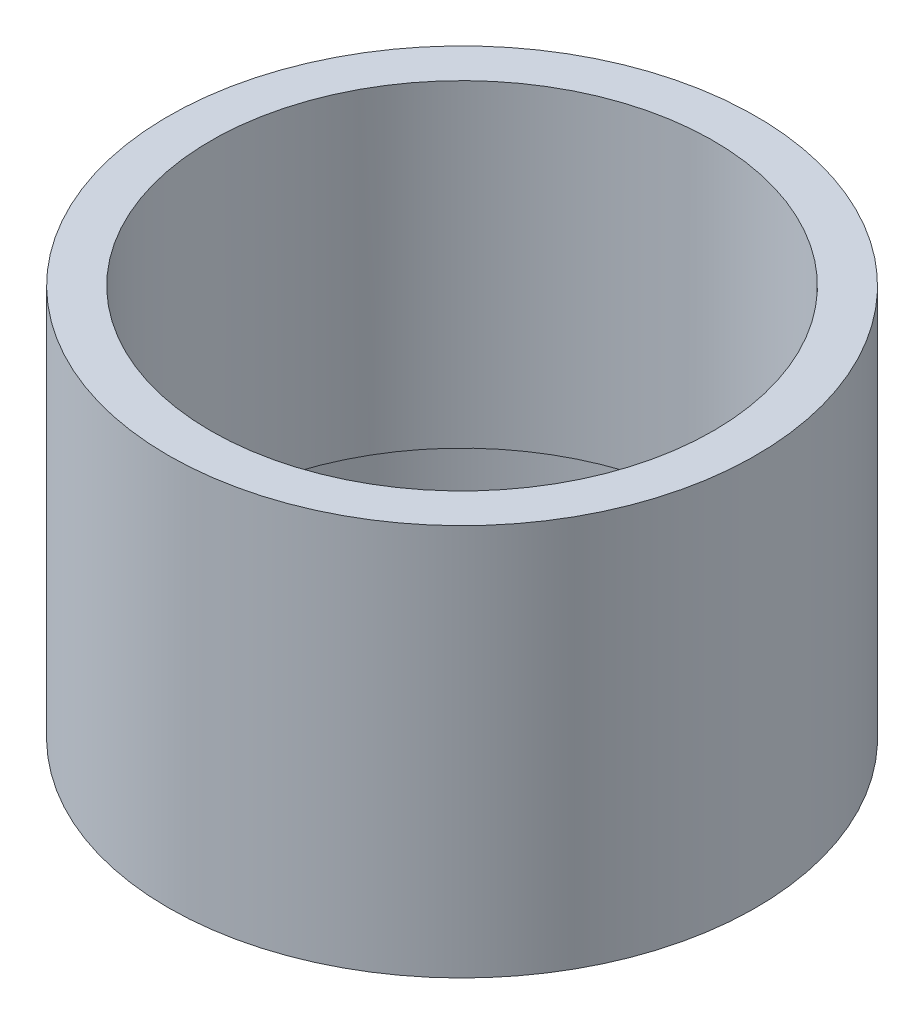
ISO-10303-21;
HEADER;
FILE_DESCRIPTION(('STEP AP214'),'2;1');
FILE_NAME('part.step','',(''),(''),'','','');
FILE_SCHEMA(('AUTOMOTIVE_DESIGN { 1 0 10303 214 1 1 1 1 }'));
ENDSEC;
DATA;
#1=APPLICATION_CONTEXT('core data for automotive mechanical design processes');
#2=APPLICATION_PROTOCOL_DEFINITION('international standard','automotive_design',2000,#1);
#3=PRODUCT_CONTEXT('',#1,'mechanical');
#4=PRODUCT('Part','Part','',(#3));
#5=PRODUCT_RELATED_PRODUCT_CATEGORY('part','',(#4));
#6=PRODUCT_DEFINITION_FORMATION('','',#4);
#7=PRODUCT_DEFINITION_CONTEXT('part definition',#1,'design');
#8=PRODUCT_DEFINITION('design','',#6,#7);
#9=PRODUCT_DEFINITION_SHAPE('','',#8);
#10=(LENGTH_UNIT() NAMED_UNIT(*) SI_UNIT(.MILLI.,.METRE.));
#11=(NAMED_UNIT(*) PLANE_ANGLE_UNIT() SI_UNIT($,.RADIAN.));
#12=(NAMED_UNIT(*) SI_UNIT($,.STERADIAN.) SOLID_ANGLE_UNIT());
#13=UNCERTAINTY_MEASURE_WITH_UNIT(LENGTH_MEASURE(1.E-05),#10,'distance_accuracy_value','');
#14=(GEOMETRIC_REPRESENTATION_CONTEXT(3) GLOBAL_UNCERTAINTY_ASSIGNED_CONTEXT((#13)) GLOBAL_UNIT_ASSIGNED_CONTEXT((#10,
#11,#12)) REPRESENTATION_CONTEXT('',''));
#15=CARTESIAN_POINT('',(0.,0.,0.));
#16=DIRECTION('',(0.,0.,1.));
#17=DIRECTION('',(1.,0.,0.));
#18=AXIS2_PLACEMENT_3D('',#15,#16,#17);
#19=CARTESIAN_POINT('',(0.,3.175,0.));
#20=DIRECTION('',(0.,1.,0.));
#21=DIRECTION('',(0.,0.,1.));
#22=AXIS2_PLACEMENT_3D('',#19,#20,#21);
#23=PLANE('',#22);
#24=CARTESIAN_POINT('',(0.,3.175,0.));
#25=DIRECTION('',(0.,1.,0.));
#26=DIRECTION('',(0.,0.,1.));
#27=AXIS2_PLACEMENT_3D('',#24,#25,#26);
#28=CIRCLE('',#27,15.875);
#29=CARTESIAN_POINT('',(0.,3.175,15.875));
#30=VERTEX_POINT('',#29);
#31=EDGE_CURVE('E343',#30,#30,#28,.T.);
#32=ORIENTED_EDGE('',*,*,#31,.F.);
#33=EDGE_LOOP('',(#32));
#34=FACE_BOUND('',#33,.T.);
#35=CARTESIAN_POINT('',(22.7552015393979,3.175,18.6369830482668));
#36=DIRECTION('',(0.,1.,0.));
#37=DIRECTION('',(0.,0.,1.));
#38=AXIS2_PLACEMENT_3D('',#35,#36,#37);
#39=CIRCLE('',#38,3.175);
#40=CARTESIAN_POINT('',(25.211505677934,3.175,20.6487471942368));
#41=VERTEX_POINT('',#40);
#42=CARTESIAN_POINT('',(24.3427015393979,3.175,15.8873523912512));
#43=VERTEX_POINT('',#42);
#44=EDGE_CURVE('E213',#41,#43,#39,.T.);
#45=ORIENTED_EDGE('',*,*,#44,.F.);
#46=CARTESIAN_POINT('',(0.,3.175,0.));
#47=DIRECTION('',(0.,1.,0.));
#48=DIRECTION('',(0.,0.,1.));
#49=AXIS2_PLACEMENT_3D('',#46,#47,#48);
#50=CIRCLE('',#49,32.5882);
#51=CARTESIAN_POINT('',(30.4880924654987,3.175,11.509430787628));
#52=VERTEX_POINT('',#51);
#53=EDGE_CURVE('E55',#41,#52,#50,.T.);
#54=ORIENTED_EDGE('',*,*,#53,.T.);
#55=CARTESIAN_POINT('',(27.5177015393979,3.175,10.38809107722));
#56=DIRECTION('',(0.,1.,0.));
#57=DIRECTION('',(0.,0.,-1.));
#58=AXIS2_PLACEMENT_3D('',#55,#56,#57);
#59=CIRCLE('',#58,3.17499999999999);
#60=CARTESIAN_POINT('',(25.9302015393979,3.175,13.1377217342356));
#61=VERTEX_POINT('',#60);
#62=EDGE_CURVE('E211',#61,#52,#59,.T.);
#63=ORIENTED_EDGE('',*,*,#62,.F.);
#64=DIRECTION('',(0.866025403784439,0.,0.5));
#65=VECTOR('',#64,1.);
#66=CARTESIAN_POINT('',(25.9302015393979,3.175,13.1377217342356));
#67=LINE('',#66,#65);
#68=CARTESIAN_POINT('',(19.5940668606941,3.175,9.47955267186422));
#69=VERTEX_POINT('',#68);
#70=EDGE_CURVE('E228',#69,#61,#67,.T.);
#71=ORIENTED_EDGE('',*,*,#70,.F.);
#72=CARTESIAN_POINT('',(21.1815668606941,3.175,6.72992201484862));
#73=DIRECTION('',(0.,1.,0.));
#74=DIRECTION('',(0.,0.,1.));
#75=AXIS2_PLACEMENT_3D('',#72,#73,#74);
#76=CIRCLE('',#75,3.175);
#77=CARTESIAN_POINT('',(18.1556287377378,3.175,5.76850458415596));
#78=VERTEX_POINT('',#77);
#79=EDGE_CURVE('E568',#78,#69,#76,.T.);
#80=ORIENTED_EDGE('',*,*,#79,.F.);
#81=CARTESIAN_POINT('',(0.,3.175,0.));
#82=DIRECTION('',(0.,-1.,0.));
#83=DIRECTION('',(0.,0.,1.));
#84=AXIS2_PLACEMENT_3D('',#81,#82,#83);
#85=CIRCLE('',#84,19.05);
#86=CARTESIAN_POINT('',(4.08214285714285,3.175,-18.6074880006377));
#87=VERTEX_POINT('',#86);
#88=EDGE_CURVE('E565',#87,#78,#85,.T.);
#89=ORIENTED_EDGE('',*,*,#88,.F.);
#90=CARTESIAN_POINT('',(4.7625,3.175,-21.708736000744));
#91=DIRECTION('',(0.,1.,0.));
#92=DIRECTION('',(0.,0.,-1.));
#93=AXIS2_PLACEMENT_3D('',#90,#91,#92);
#94=CIRCLE('',#93,3.175);
#95=CARTESIAN_POINT('',(1.5875,3.175,-21.708736000744));
#96=VERTEX_POINT('',#95);
#97=EDGE_CURVE('E562',#96,#87,#94,.T.);
#98=ORIENTED_EDGE('',*,*,#97,.F.);
#99=DIRECTION('',(0.,0.,1.));
#100=VECTOR('',#99,1.);
#101=CARTESIAN_POINT('',(1.5875,3.175,-29.0250741254867));
#102=LINE('',#101,#100);
#103=CARTESIAN_POINT('',(1.5875,3.175,-29.0250741254867));
#104=VERTEX_POINT('',#103);
#105=EDGE_CURVE('E559',#104,#96,#102,.T.);
#106=ORIENTED_EDGE('',*,*,#105,.F.);
#107=CARTESIAN_POINT('',(4.7625,3.175,-29.0250741254867));
#108=DIRECTION('',(0.,1.,0.));
#109=DIRECTION('',(0.,0.,1.));
#110=AXIS2_PLACEMENT_3D('',#107,#108,#109);
#111=CIRCLE('',#110,3.175);
#112=CARTESIAN_POINT('',(5.27658678756477,3.175,-32.1581779818648));
#113=VERTEX_POINT('',#112);
#114=EDGE_CURVE('E556',#113,#104,#111,.T.);
#115=ORIENTED_EDGE('',*,*,#114,.F.);
#116=CARTESIAN_POINT('',(-5.27658678756475,3.175,-32.1581779818648));
#117=VERTEX_POINT('',#116);
#118=EDGE_CURVE('E11',#113,#117,#50,.T.);
#119=ORIENTED_EDGE('',*,*,#118,.T.);
#120=CARTESIAN_POINT('',(-4.7625,3.175,-29.0250741254867));
#121=DIRECTION('',(0.,1.,0.));
#122=DIRECTION('',(0.,0.,-1.));
#123=AXIS2_PLACEMENT_3D('',#120,#121,#122);
#124=CIRCLE('',#123,3.175);
#125=CARTESIAN_POINT('',(-1.5875,3.175,-29.0250741254867));
#126=VERTEX_POINT('',#125);
#127=EDGE_CURVE('E262',#126,#117,#124,.T.);
#128=ORIENTED_EDGE('',*,*,#127,.F.);
#129=DIRECTION('',(0.,0.,-1.));
#130=VECTOR('',#129,1.);
#131=CARTESIAN_POINT('',(-1.5875,3.175,-29.0250741254867));
#132=LINE('',#131,#130);
#133=CARTESIAN_POINT('',(-1.5875,3.175,-21.708736000744));
#134=VERTEX_POINT('',#133);
#135=EDGE_CURVE('E283',#134,#126,#132,.T.);
#136=ORIENTED_EDGE('',*,*,#135,.F.);
#137=CARTESIAN_POINT('',(-4.7625,3.175,-21.708736000744));
#138=DIRECTION('',(0.,1.,0.));
#139=DIRECTION('',(0.,0.,1.));
#140=AXIS2_PLACEMENT_3D('',#137,#138,#139);
#141=CIRCLE('',#140,3.175);
#142=CARTESIAN_POINT('',(-4.08214285714285,3.175,-18.6074880006377));
#143=VERTEX_POINT('',#142);
#144=EDGE_CURVE('E279',#143,#134,#141,.T.);
#145=ORIENTED_EDGE('',*,*,#144,.F.);
#146=CARTESIAN_POINT('',(0.,3.175,0.));
#147=DIRECTION('',(0.,-1.,0.));
#148=DIRECTION('',(0.,0.,1.));
#149=AXIS2_PLACEMENT_3D('',#146,#147,#148);
#150=CIRCLE('',#149,19.05);
#151=CARTESIAN_POINT('',(-18.1556287377378,3.175,5.76850458415598));
#152=VERTEX_POINT('',#151);
#153=EDGE_CURVE('E276',#152,#143,#150,.T.);
#154=ORIENTED_EDGE('',*,*,#153,.F.);
#155=CARTESIAN_POINT('',(-21.1815668606941,3.175,6.72992201484864));
#156=DIRECTION('',(0.,1.,0.));
#157=DIRECTION('',(0.,0.,-1.));
#158=AXIS2_PLACEMENT_3D('',#155,#156,#157);
#159=CIRCLE('',#158,3.175);
#160=CARTESIAN_POINT('',(-19.5940668606941,3.175,9.47955267186423));
#161=VERTEX_POINT('',#160);
#162=EDGE_CURVE('E273',#161,#152,#159,.T.);
#163=ORIENTED_EDGE('',*,*,#162,.F.);
#164=DIRECTION('',(0.866025403784438,0.,-0.500000000000001));
#165=VECTOR('',#164,1.);
#166=CARTESIAN_POINT('',(-25.9302015393979,3.175,13.1377217342356));
#167=LINE('',#166,#165);
#168=CARTESIAN_POINT('',(-25.9302015393979,3.175,13.1377217342356));
#169=VERTEX_POINT('',#168);
#170=EDGE_CURVE('E270',#169,#161,#167,.T.);
#171=ORIENTED_EDGE('',*,*,#170,.F.);
#172=CARTESIAN_POINT('',(-27.5177015393979,3.175,10.38809107722));
#173=DIRECTION('',(0.,1.,0.));
#174=DIRECTION('',(0.,0.,1.));
#175=AXIS2_PLACEMENT_3D('',#172,#173,#174);
#176=CIRCLE('',#175,3.175);
#177=CARTESIAN_POINT('',(-30.4880924654987,3.175,11.509430787628));
#178=VERTEX_POINT('',#177);
#179=EDGE_CURVE('E266',#178,#169,#176,.T.);
#180=ORIENTED_EDGE('',*,*,#179,.F.);
#181=CARTESIAN_POINT('',(-25.2115056779339,3.175,20.6487471942368));
#182=VERTEX_POINT('',#181);
#183=EDGE_CURVE('E53',#178,#182,#50,.T.);
#184=ORIENTED_EDGE('',*,*,#183,.T.);
#185=CARTESIAN_POINT('',(-22.7552015393979,3.175,18.6369830482668));
#186=DIRECTION('',(0.,1.,0.));
#187=DIRECTION('',(0.,0.,-1.));
#188=AXIS2_PLACEMENT_3D('',#185,#186,#187);
#189=CIRCLE('',#188,3.175);
#190=CARTESIAN_POINT('',(-24.3427015393979,3.175,15.8873523912512));
#191=VERTEX_POINT('',#190);
#192=EDGE_CURVE('E492',#191,#182,#189,.T.);
#193=ORIENTED_EDGE('',*,*,#192,.F.);
#194=DIRECTION('',(-0.866025403784438,0.,0.500000000000001));
#195=VECTOR('',#194,1.);
#196=CARTESIAN_POINT('',(-24.3427015393979,3.175,15.8873523912512));
#197=LINE('',#196,#195);
#198=CARTESIAN_POINT('',(-18.0065668606941,3.175,12.2291833288798));
#199=VERTEX_POINT('',#198);
#200=EDGE_CURVE('E489',#199,#191,#197,.T.);
#201=ORIENTED_EDGE('',*,*,#200,.F.);
#202=CARTESIAN_POINT('',(-16.4190668606941,3.175,14.9788139858954));
#203=DIRECTION('',(0.,1.,0.));
#204=DIRECTION('',(0.,0.,1.));
#205=AXIS2_PLACEMENT_3D('',#202,#203,#204);
#206=CIRCLE('',#205,3.175);
#207=CARTESIAN_POINT('',(-14.073485880595,3.175,12.8389834164818));
#208=VERTEX_POINT('',#207);
#209=EDGE_CURVE('E485',#208,#199,#206,.T.);
#210=ORIENTED_EDGE('',*,*,#209,.F.);
#211=CARTESIAN_POINT('',(0.,3.175,0.));
#212=DIRECTION('',(0.,-1.,0.));
#213=DIRECTION('',(0.,0.,1.));
#214=AXIS2_PLACEMENT_3D('',#211,#212,#213);
#215=CIRCLE('',#214,19.05);
#216=CARTESIAN_POINT('',(14.073485880595,3.175,12.8389834164818));
#217=VERTEX_POINT('',#216);
#218=EDGE_CURVE('E482',#217,#208,#215,.T.);
#219=ORIENTED_EDGE('',*,*,#218,.F.);
#220=CARTESIAN_POINT('',(16.4190668606941,3.175,14.9788139858954));
#221=DIRECTION('',(0.,1.,0.));
#222=DIRECTION('',(0.,0.,-1.));
#223=AXIS2_PLACEMENT_3D('',#220,#221,#222);
#224=CIRCLE('',#223,3.175);
#225=CARTESIAN_POINT('',(18.0065668606941,3.175,12.2291833288798));
#226=VERTEX_POINT('',#225);
#227=EDGE_CURVE('E501',#226,#217,#224,.T.);
#228=ORIENTED_EDGE('',*,*,#227,.F.);
#229=DIRECTION('',(-0.866025403784439,0.,-0.5));
#230=VECTOR('',#229,1.);
#231=CARTESIAN_POINT('',(24.3427015393979,3.175,15.8873523912512));
#232=LINE('',#231,#230);
#233=EDGE_CURVE('E498',#43,#226,#232,.T.);
#234=ORIENTED_EDGE('',*,*,#233,.F.);
#235=EDGE_LOOP('',(#45,#54,#63,#71,#80,#89,#98,#106,#115,#119,#128,#136,#145,#154,#163,#171,
#180,#184,#193,#201,#210,#219,#228,#234));
#236=FACE_BOUND('',#235,.T.);
#237=ADVANCED_FACE('F43',(#34,#236),#23,.T.);
#238=CARTESIAN_POINT('',(0.,-9.525,0.));
#239=DIRECTION('',(0.,1.,0.));
#240=DIRECTION('',(0.,0.,1.));
#241=AXIS2_PLACEMENT_3D('',#238,#239,#240);
#242=CYLINDRICAL_SURFACE('',#241,38.1);
#243=CARTESIAN_POINT('',(0.,-9.525,0.));
#244=DIRECTION('',(0.,1.,0.));
#245=DIRECTION('',(0.,0.,1.));
#246=AXIS2_PLACEMENT_3D('',#243,#244,#245);
#247=CIRCLE('',#246,38.1);
#248=CARTESIAN_POINT('',(0.,-9.525,38.1));
#249=VERTEX_POINT('',#248);
#250=EDGE_CURVE('E47',#249,#249,#247,.T.);
#251=ORIENTED_EDGE('',*,*,#250,.T.);
#252=EDGE_LOOP('',(#251));
#253=FACE_BOUND('',#252,.T.);
#254=CARTESIAN_POINT('',(0.,41.275,0.));
#255=DIRECTION('',(0.,1.,0.));
#256=DIRECTION('',(0.,0.,1.));
#257=AXIS2_PLACEMENT_3D('',#254,#255,#256);
#258=CIRCLE('',#257,38.1);
#259=CARTESIAN_POINT('',(0.,41.275,38.1));
#260=VERTEX_POINT('',#259);
#261=EDGE_CURVE('E474',#260,#260,#258,.T.);
#262=ORIENTED_EDGE('',*,*,#261,.F.);
#263=EDGE_LOOP('',(#262));
#264=FACE_BOUND('',#263,.T.);
#265=ADVANCED_FACE('F45',(#253,#264),#242,.T.);
#266=CARTESIAN_POINT('',(0.,-9.525,0.));
#267=DIRECTION('',(0.,1.,0.));
#268=DIRECTION('',(0.,0.,1.));
#269=AXIS2_PLACEMENT_3D('',#266,#267,#268);
#270=PLANE('',#269);
#271=CARTESIAN_POINT('',(0.,-9.525,0.));
#272=DIRECTION('',(0.,1.,0.));
#273=DIRECTION('',(0.,0.,1.));
#274=AXIS2_PLACEMENT_3D('',#271,#272,#273);
#275=CIRCLE('',#274,33.0835);
#276=CARTESIAN_POINT('',(0.,-9.525,33.0835));
#277=VERTEX_POINT('',#276);
#278=EDGE_CURVE('E351',#277,#277,#275,.T.);
#279=ORIENTED_EDGE('',*,*,#278,.T.);
#280=EDGE_LOOP('',(#279));
#281=FACE_BOUND('',#280,.T.);
#282=ORIENTED_EDGE('',*,*,#250,.F.);
#283=EDGE_LOOP('',(#282));
#284=FACE_BOUND('',#283,.T.);
#285=ADVANCED_FACE('F372',(#281,#284),#270,.F.);
#286=CARTESIAN_POINT('',(0.,-9.525,0.));
#287=DIRECTION('',(0.,1.,0.));
#288=DIRECTION('',(0.,0.,1.));
#289=AXIS2_PLACEMENT_3D('',#286,#287,#288);
#290=CYLINDRICAL_SURFACE('',#289,33.0835);
#291=ORIENTED_EDGE('',*,*,#278,.F.);
#292=EDGE_LOOP('',(#291));
#293=FACE_BOUND('',#292,.T.);
#294=CARTESIAN_POINT('',(0.,0.,0.));
#295=DIRECTION('',(0.,1.,0.));
#296=DIRECTION('',(0.,0.,1.));
#297=AXIS2_PLACEMENT_3D('',#294,#295,#296);
#298=CIRCLE('',#297,33.0835);
#299=CARTESIAN_POINT('',(0.,0.,33.0835));
#300=VERTEX_POINT('',#299);
#301=EDGE_CURVE('E347',#300,#300,#298,.T.);
#302=ORIENTED_EDGE('',*,*,#301,.T.);
#303=EDGE_LOOP('',(#302));
#304=FACE_BOUND('',#303,.T.);
#305=ADVANCED_FACE('F358',(#293,#304),#290,.F.);
#306=CARTESIAN_POINT('',(0.,0.,0.));
#307=DIRECTION('',(0.,1.,0.));
#308=DIRECTION('',(0.,0.,1.));
#309=AXIS2_PLACEMENT_3D('',#306,#307,#308);
#310=PLANE('',#309);
#311=CARTESIAN_POINT('',(0.,0.,0.));
#312=DIRECTION('',(0.,-1.,0.));
#313=DIRECTION('',(0.,0.,1.));
#314=AXIS2_PLACEMENT_3D('',#311,#312,#313);
#315=CIRCLE('',#314,19.05);
#316=CARTESIAN_POINT('',(14.073485880595,0.,12.8389834164818));
#317=VERTEX_POINT('',#316);
#318=CARTESIAN_POINT('',(-14.073485880595,0.,12.8389834164818));
#319=VERTEX_POINT('',#318);
#320=EDGE_CURVE('E70',#317,#319,#315,.T.);
#321=ORIENTED_EDGE('',*,*,#320,.T.);
#322=CARTESIAN_POINT('',(-16.4190668606941,0.,14.9788139858954));
#323=DIRECTION('',(0.,1.,0.));
#324=DIRECTION('',(0.,0.,1.));
#325=AXIS2_PLACEMENT_3D('',#322,#323,#324);
#326=CIRCLE('',#325,3.175);
#327=CARTESIAN_POINT('',(-18.0065668606941,0.,12.2291833288798));
#328=VERTEX_POINT('',#327);
#329=EDGE_CURVE('E507',#319,#328,#326,.T.);
#330=ORIENTED_EDGE('',*,*,#329,.T.);
#331=DIRECTION('',(-0.866025403784438,0.,0.500000000000001));
#332=VECTOR('',#331,1.);
#333=CARTESIAN_POINT('',(-24.3427015393979,0.,15.8873523912512));
#334=LINE('',#333,#332);
#335=CARTESIAN_POINT('',(-24.3427015393979,0.,15.8873523912512));
#336=VERTEX_POINT('',#335);
#337=EDGE_CURVE('E511',#328,#336,#334,.T.);
#338=ORIENTED_EDGE('',*,*,#337,.T.);
#339=CARTESIAN_POINT('',(-22.7552015393979,0.,18.6369830482668));
#340=DIRECTION('',(0.,1.,0.));
#341=DIRECTION('',(0.,0.,-1.));
#342=AXIS2_PLACEMENT_3D('',#339,#340,#341);
#343=CIRCLE('',#342,3.175);
#344=CARTESIAN_POINT('',(-25.2115056779339,0.,20.6487471942368));
#345=VERTEX_POINT('',#344);
#346=EDGE_CURVE('E515',#336,#345,#343,.T.);
#347=ORIENTED_EDGE('',*,*,#346,.T.);
#348=CARTESIAN_POINT('',(0.,0.,0.));
#349=DIRECTION('',(0.,1.,0.));
#350=DIRECTION('',(0.,0.,1.));
#351=AXIS2_PLACEMENT_3D('',#348,#349,#350);
#352=CIRCLE('',#351,32.5882);
#353=CARTESIAN_POINT('',(25.211505677934,0.,20.6487471942368));
#354=VERTEX_POINT('',#353);
#355=EDGE_CURVE('E519',#345,#354,#352,.T.);
#356=ORIENTED_EDGE('',*,*,#355,.T.);
#357=CARTESIAN_POINT('',(22.7552015393979,0.,18.6369830482668));
#358=DIRECTION('',(0.,1.,0.));
#359=DIRECTION('',(0.,0.,1.));
#360=AXIS2_PLACEMENT_3D('',#357,#358,#359);
#361=CIRCLE('',#360,3.175);
#362=CARTESIAN_POINT('',(24.3427015393979,0.,15.8873523912512));
#363=VERTEX_POINT('',#362);
#364=EDGE_CURVE('E523',#354,#363,#361,.T.);
#365=ORIENTED_EDGE('',*,*,#364,.T.);
#366=DIRECTION('',(-0.866025403784439,0.,-0.5));
#367=VECTOR('',#366,1.);
#368=CARTESIAN_POINT('',(24.3427015393979,0.,15.8873523912512));
#369=LINE('',#368,#367);
#370=CARTESIAN_POINT('',(18.0065668606941,0.,12.2291833288798));
#371=VERTEX_POINT('',#370);
#372=EDGE_CURVE('E527',#363,#371,#369,.T.);
#373=ORIENTED_EDGE('',*,*,#372,.T.);
#374=CARTESIAN_POINT('',(16.4190668606941,0.,14.9788139858954));
#375=DIRECTION('',(0.,1.,0.));
#376=DIRECTION('',(0.,0.,-1.));
#377=AXIS2_PLACEMENT_3D('',#374,#375,#376);
#378=CIRCLE('',#377,3.175);
#379=EDGE_CURVE('E486',#371,#317,#378,.T.);
#380=ORIENTED_EDGE('',*,*,#379,.T.);
#381=EDGE_LOOP('',(#321,#330,#338,#347,#356,#365,#373,#380));
#382=FACE_BOUND('',#381,.T.);
#383=CARTESIAN_POINT('',(-4.7625,0.,-29.0250741254867));
#384=DIRECTION('',(0.,1.,0.));
#385=DIRECTION('',(0.,0.,-1.));
#386=AXIS2_PLACEMENT_3D('',#383,#384,#385);
#387=CIRCLE('',#386,3.175);
#388=CARTESIAN_POINT('',(-1.5875,0.,-29.0250741254867));
#389=VERTEX_POINT('',#388);
#390=CARTESIAN_POINT('',(-5.27658678756475,0.,-32.1581779818648));
#391=VERTEX_POINT('',#390);
#392=EDGE_CURVE('E261',#389,#391,#387,.T.);
#393=ORIENTED_EDGE('',*,*,#392,.T.);
#394=CARTESIAN_POINT('',(0.,0.,0.));
#395=DIRECTION('',(0.,1.,0.));
#396=DIRECTION('',(0.,0.,1.));
#397=AXIS2_PLACEMENT_3D('',#394,#395,#396);
#398=CIRCLE('',#397,32.5882);
#399=CARTESIAN_POINT('',(-30.4880924654987,0.,11.509430787628));
#400=VERTEX_POINT('',#399);
#401=EDGE_CURVE('E290',#391,#400,#398,.T.);
#402=ORIENTED_EDGE('',*,*,#401,.T.);
#403=CARTESIAN_POINT('',(-27.5177015393979,0.,10.38809107722));
#404=DIRECTION('',(0.,1.,0.));
#405=DIRECTION('',(0.,0.,1.));
#406=AXIS2_PLACEMENT_3D('',#403,#404,#405);
#407=CIRCLE('',#406,3.175);
#408=CARTESIAN_POINT('',(-25.9302015393979,0.,13.1377217342356));
#409=VERTEX_POINT('',#408);
#410=EDGE_CURVE('E294',#400,#409,#407,.T.);
#411=ORIENTED_EDGE('',*,*,#410,.T.);
#412=DIRECTION('',(0.866025403784438,0.,-0.500000000000001));
#413=VECTOR('',#412,1.);
#414=CARTESIAN_POINT('',(-25.9302015393979,0.,13.1377217342356));
#415=LINE('',#414,#413);
#416=CARTESIAN_POINT('',(-19.5940668606941,0.,9.47955267186423));
#417=VERTEX_POINT('',#416);
#418=EDGE_CURVE('E298',#409,#417,#415,.T.);
#419=ORIENTED_EDGE('',*,*,#418,.T.);
#420=CARTESIAN_POINT('',(-21.1815668606941,0.,6.72992201484864));
#421=DIRECTION('',(0.,1.,0.));
#422=DIRECTION('',(0.,0.,-1.));
#423=AXIS2_PLACEMENT_3D('',#420,#421,#422);
#424=CIRCLE('',#423,3.175);
#425=CARTESIAN_POINT('',(-18.1556287377378,0.,5.76850458415598));
#426=VERTEX_POINT('',#425);
#427=EDGE_CURVE('E302',#417,#426,#424,.T.);
#428=ORIENTED_EDGE('',*,*,#427,.T.);
#429=CARTESIAN_POINT('',(0.,0.,0.));
#430=DIRECTION('',(0.,-1.,0.));
#431=DIRECTION('',(0.,0.,1.));
#432=AXIS2_PLACEMENT_3D('',#429,#430,#431);
#433=CIRCLE('',#432,19.05);
#434=CARTESIAN_POINT('',(-4.08214285714285,0.,-18.6074880006377));
#435=VERTEX_POINT('',#434);
#436=EDGE_CURVE('E306',#426,#435,#433,.T.);
#437=ORIENTED_EDGE('',*,*,#436,.T.);
#438=CARTESIAN_POINT('',(-4.7625,0.,-21.708736000744));
#439=DIRECTION('',(0.,1.,0.));
#440=DIRECTION('',(0.,0.,1.));
#441=AXIS2_PLACEMENT_3D('',#438,#439,#440);
#442=CIRCLE('',#441,3.175);
#443=CARTESIAN_POINT('',(-1.5875,0.,-21.708736000744));
#444=VERTEX_POINT('',#443);
#445=EDGE_CURVE('E310',#435,#444,#442,.T.);
#446=ORIENTED_EDGE('',*,*,#445,.T.);
#447=DIRECTION('',(0.,0.,-1.));
#448=VECTOR('',#447,1.);
#449=CARTESIAN_POINT('',(-1.5875,0.,-29.0250741254867));
#450=LINE('',#449,#448);
#451=EDGE_CURVE('E267',#444,#389,#450,.T.);
#452=ORIENTED_EDGE('',*,*,#451,.T.);
#453=EDGE_LOOP('',(#393,#402,#411,#419,#428,#437,#446,#452));
#454=FACE_BOUND('',#453,.T.);
#455=CARTESIAN_POINT('',(0.,0.,0.));
#456=DIRECTION('',(0.,1.,0.));
#457=DIRECTION('',(0.,0.,1.));
#458=AXIS2_PLACEMENT_3D('',#455,#456,#457);
#459=CIRCLE('',#458,15.875);
#460=CARTESIAN_POINT('',(0.,0.,15.875));
#461=VERTEX_POINT('',#460);
#462=EDGE_CURVE('E342',#461,#461,#459,.T.);
#463=ORIENTED_EDGE('',*,*,#462,.T.);
#464=EDGE_LOOP('',(#463));
#465=FACE_BOUND('',#464,.T.);
#466=CARTESIAN_POINT('',(0.,0.,0.));
#467=DIRECTION('',(0.,1.,0.));
#468=DIRECTION('',(0.,0.,1.));
#469=AXIS2_PLACEMENT_3D('',#466,#467,#468);
#470=CIRCLE('',#469,32.5882);
#471=CARTESIAN_POINT('',(30.4880924654987,0.,11.509430787628));
#472=VERTEX_POINT('',#471);
#473=CARTESIAN_POINT('',(5.27658678756477,0.,-32.1581779818648));
#474=VERTEX_POINT('',#473);
#475=EDGE_CURVE('E234',#472,#474,#470,.T.);
#476=ORIENTED_EDGE('',*,*,#475,.T.);
#477=CARTESIAN_POINT('',(4.7625,0.,-29.0250741254867));
#478=DIRECTION('',(0.,1.,0.));
#479=DIRECTION('',(0.,0.,1.));
#480=AXIS2_PLACEMENT_3D('',#477,#478,#479);
#481=CIRCLE('',#480,3.175);
#482=CARTESIAN_POINT('',(1.5875,0.,-29.0250741254867));
#483=VERTEX_POINT('',#482);
#484=EDGE_CURVE('E575',#474,#483,#481,.T.);
#485=ORIENTED_EDGE('',*,*,#484,.T.);
#486=DIRECTION('',(0.,0.,1.));
#487=VECTOR('',#486,1.);
#488=CARTESIAN_POINT('',(1.5875,0.,-29.0250741254867));
#489=LINE('',#488,#487);
#490=CARTESIAN_POINT('',(1.5875,0.,-21.708736000744));
#491=VERTEX_POINT('',#490);
#492=EDGE_CURVE('E579',#483,#491,#489,.T.);
#493=ORIENTED_EDGE('',*,*,#492,.T.);
#494=CARTESIAN_POINT('',(4.7625,0.,-21.708736000744));
#495=DIRECTION('',(0.,1.,0.));
#496=DIRECTION('',(0.,0.,-1.));
#497=AXIS2_PLACEMENT_3D('',#494,#495,#496);
#498=CIRCLE('',#497,3.175);
#499=CARTESIAN_POINT('',(4.08214285714285,0.,-18.6074880006377));
#500=VERTEX_POINT('',#499);
#501=EDGE_CURVE('E583',#491,#500,#498,.T.);
#502=ORIENTED_EDGE('',*,*,#501,.T.);
#503=CARTESIAN_POINT('',(0.,0.,0.));
#504=DIRECTION('',(0.,-1.,0.));
#505=DIRECTION('',(0.,0.,1.));
#506=AXIS2_PLACEMENT_3D('',#503,#504,#505);
#507=CIRCLE('',#506,19.05);
#508=CARTESIAN_POINT('',(18.1556287377378,0.,5.76850458415596));
#509=VERTEX_POINT('',#508);
#510=EDGE_CURVE('E587',#500,#509,#507,.T.);
#511=ORIENTED_EDGE('',*,*,#510,.T.);
#512=CARTESIAN_POINT('',(21.1815668606941,0.,6.72992201484862));
#513=DIRECTION('',(0.,1.,0.));
#514=DIRECTION('',(0.,0.,1.));
#515=AXIS2_PLACEMENT_3D('',#512,#513,#514);
#516=CIRCLE('',#515,3.175);
#517=CARTESIAN_POINT('',(19.5940668606941,0.,9.47955267186422));
#518=VERTEX_POINT('',#517);
#519=EDGE_CURVE('E591',#509,#518,#516,.T.);
#520=ORIENTED_EDGE('',*,*,#519,.T.);
#521=DIRECTION('',(0.866025403784439,0.,0.5));
#522=VECTOR('',#521,1.);
#523=CARTESIAN_POINT('',(25.9302015393979,0.,13.1377217342356));
#524=LINE('',#523,#522);
#525=CARTESIAN_POINT('',(25.9302015393979,0.,13.1377217342356));
#526=VERTEX_POINT('',#525);
#527=EDGE_CURVE('E594',#518,#526,#524,.T.);
#528=ORIENTED_EDGE('',*,*,#527,.T.);
#529=CARTESIAN_POINT('',(27.5177015393979,0.,10.38809107722));
#530=DIRECTION('',(0.,1.,0.));
#531=DIRECTION('',(0.,0.,-1.));
#532=AXIS2_PLACEMENT_3D('',#529,#530,#531);
#533=CIRCLE('',#532,3.17499999999999);
#534=EDGE_CURVE('E241',#526,#472,#533,.T.);
#535=ORIENTED_EDGE('',*,*,#534,.T.);
#536=EDGE_LOOP('',(#476,#485,#493,#502,#511,#520,#528,#535));
#537=FACE_BOUND('',#536,.T.);
#538=ORIENTED_EDGE('',*,*,#301,.F.);
#539=EDGE_LOOP('',(#538));
#540=FACE_BOUND('',#539,.T.);
#541=ADVANCED_FACE('F360',(#382,#454,#465,#537,#540),#310,.F.);
#542=CARTESIAN_POINT('',(0.,3.175,0.));
#543=DIRECTION('',(0.,-1.,0.));
#544=DIRECTION('',(0.,0.,-1.));
#545=AXIS2_PLACEMENT_3D('',#542,#543,#544);
#546=CYLINDRICAL_SURFACE('',#545,15.875);
#547=ORIENTED_EDGE('',*,*,#31,.T.);
#548=EDGE_LOOP('',(#547));
#549=FACE_BOUND('',#548,.T.);
#550=ORIENTED_EDGE('',*,*,#462,.F.);
#551=EDGE_LOOP('',(#550));
#552=FACE_BOUND('',#551,.T.);
#553=ADVANCED_FACE('F362',(#549,#552),#546,.F.);
#554=CARTESIAN_POINT('',(-4.7625,3.175,-29.0250741254867));
#555=DIRECTION('',(0.,-1.,0.));
#556=DIRECTION('',(0.,0.,-1.));
#557=AXIS2_PLACEMENT_3D('',#554,#555,#556);
#558=CYLINDRICAL_SURFACE('',#557,3.175);
#559=ORIENTED_EDGE('',*,*,#392,.F.);
#560=DIRECTION('',(0.,-1.,0.));
#561=VECTOR('',#560,1.);
#562=CARTESIAN_POINT('',(-1.5875,3.175,-29.0250741254867));
#563=LINE('',#562,#561);
#564=EDGE_CURVE('E286',#126,#389,#563,.T.);
#565=ORIENTED_EDGE('',*,*,#564,.F.);
#566=ORIENTED_EDGE('',*,*,#127,.T.);
#567=DIRECTION('',(0.,-1.,0.));
#568=VECTOR('',#567,1.);
#569=CARTESIAN_POINT('',(-5.27658678756475,3.175,-32.1581779818648));
#570=LINE('',#569,#568);
#571=EDGE_CURVE('E338',#117,#391,#570,.T.);
#572=ORIENTED_EDGE('',*,*,#571,.T.);
#573=EDGE_LOOP('',(#559,#565,#566,#572));
#574=FACE_BOUND('',#573,.T.);
#575=ADVANCED_FACE('F369',(#574),#558,.F.);
#576=CARTESIAN_POINT('',(0.,3.175,0.));
#577=DIRECTION('',(0.,-1.,0.));
#578=DIRECTION('',(0.,0.,-1.));
#579=AXIS2_PLACEMENT_3D('',#576,#577,#578);
#580=CYLINDRICAL_SURFACE('',#579,32.5882);
#581=ORIENTED_EDGE('',*,*,#401,.F.);
#582=ORIENTED_EDGE('',*,*,#571,.F.);
#583=ORIENTED_EDGE('',*,*,#118,.F.);
#584=DIRECTION('',(0.,-1.,0.));
#585=VECTOR('',#584,1.);
#586=CARTESIAN_POINT('',(5.27658678756477,3.175,-32.1581779818648));
#587=LINE('',#586,#585);
#588=EDGE_CURVE('E258',#113,#474,#587,.T.);
#589=ORIENTED_EDGE('',*,*,#588,.T.);
#590=ORIENTED_EDGE('',*,*,#475,.F.);
#591=DIRECTION('',(0.,-1.,0.));
#592=VECTOR('',#591,1.);
#593=CARTESIAN_POINT('',(30.4880924654987,3.175,11.509430787628));
#594=LINE('',#593,#592);
#595=EDGE_CURVE('E223',#52,#472,#594,.T.);
#596=ORIENTED_EDGE('',*,*,#595,.F.);
#597=ORIENTED_EDGE('',*,*,#53,.F.);
#598=DIRECTION('',(0.,-1.,0.));
#599=VECTOR('',#598,1.);
#600=CARTESIAN_POINT('',(25.211505677934,3.175,20.6487471942368));
#601=LINE('',#600,#599);
#602=EDGE_CURVE('E541',#41,#354,#601,.T.);
#603=ORIENTED_EDGE('',*,*,#602,.T.);
#604=ORIENTED_EDGE('',*,*,#355,.F.);
#605=DIRECTION('',(0.,-1.,0.));
#606=VECTOR('',#605,1.);
#607=CARTESIAN_POINT('',(-25.2115056779339,3.175,20.6487471942368));
#608=LINE('',#607,#606);
#609=EDGE_CURVE('E544',#182,#345,#608,.T.);
#610=ORIENTED_EDGE('',*,*,#609,.F.);
#611=ORIENTED_EDGE('',*,*,#183,.F.);
#612=DIRECTION('',(0.,-1.,0.));
#613=VECTOR('',#612,1.);
#614=CARTESIAN_POINT('',(-30.4880924654987,3.175,11.509430787628));
#615=LINE('',#614,#613);
#616=EDGE_CURVE('E335',#178,#400,#615,.T.);
#617=ORIENTED_EDGE('',*,*,#616,.T.);
#618=EDGE_LOOP('',(#581,#582,#583,#589,#590,#596,#597,#603,#604,#610,#611,#617));
#619=FACE_BOUND('',#618,.T.);
#620=CARTESIAN_POINT('',(0.,41.275,0.));
#621=DIRECTION('',(0.,1.,0.));
#622=DIRECTION('',(0.,0.,1.));
#623=AXIS2_PLACEMENT_3D('',#620,#621,#622);
#624=CIRCLE('',#623,32.5882);
#625=CARTESIAN_POINT('',(0.,41.275,32.5882));
#626=VERTEX_POINT('',#625);
#627=EDGE_CURVE('E218',#626,#626,#624,.T.);
#628=ORIENTED_EDGE('',*,*,#627,.T.);
#629=EDGE_LOOP('',(#628));
#630=FACE_BOUND('',#629,.T.);
#631=ADVANCED_FACE('F230',(#619,#630),#580,.F.);
#632=CARTESIAN_POINT('',(-27.5177015393979,3.175,10.38809107722));
#633=DIRECTION('',(0.,-1.,0.));
#634=DIRECTION('',(0.,0.,-1.));
#635=AXIS2_PLACEMENT_3D('',#632,#633,#634);
#636=CYLINDRICAL_SURFACE('',#635,3.175);
#637=ORIENTED_EDGE('',*,*,#410,.F.);
#638=ORIENTED_EDGE('',*,*,#616,.F.);
#639=ORIENTED_EDGE('',*,*,#179,.T.);
#640=DIRECTION('',(0.,-1.,0.));
#641=VECTOR('',#640,1.);
#642=CARTESIAN_POINT('',(-25.9302015393979,3.175,13.1377217342356));
#643=LINE('',#642,#641);
#644=EDGE_CURVE('E332',#169,#409,#643,.T.);
#645=ORIENTED_EDGE('',*,*,#644,.T.);
#646=EDGE_LOOP('',(#637,#638,#639,#645));
#647=FACE_BOUND('',#646,.T.);
#648=ADVANCED_FACE('F390',(#647),#636,.F.);
#649=CARTESIAN_POINT('',(-25.9302015393979,3.175,13.1377217342356));
#650=DIRECTION('',(-0.500000000000001,0.,-0.866025403784438));
#651=DIRECTION('',(-0.866025403784438,0.,0.500000000000001));
#652=AXIS2_PLACEMENT_3D('',#649,#650,#651);
#653=PLANE('',#652);
#654=ORIENTED_EDGE('',*,*,#418,.F.);
#655=ORIENTED_EDGE('',*,*,#644,.F.);
#656=ORIENTED_EDGE('',*,*,#170,.T.);
#657=DIRECTION('',(0.,-1.,0.));
#658=VECTOR('',#657,1.);
#659=CARTESIAN_POINT('',(-19.5940668606941,3.175,9.47955267186423));
#660=LINE('',#659,#658);
#661=EDGE_CURVE('E329',#161,#417,#660,.T.);
#662=ORIENTED_EDGE('',*,*,#661,.T.);
#663=EDGE_LOOP('',(#654,#655,#656,#662));
#664=FACE_BOUND('',#663,.T.);
#665=ADVANCED_FACE('F393',(#664),#653,.T.);
#666=CARTESIAN_POINT('',(-21.1815668606941,3.175,6.72992201484864));
#667=DIRECTION('',(0.,-1.,0.));
#668=DIRECTION('',(0.,0.,-1.));
#669=AXIS2_PLACEMENT_3D('',#666,#667,#668);
#670=CYLINDRICAL_SURFACE('',#669,3.175);
#671=ORIENTED_EDGE('',*,*,#427,.F.);
#672=ORIENTED_EDGE('',*,*,#661,.F.);
#673=ORIENTED_EDGE('',*,*,#162,.T.);
#674=DIRECTION('',(0.,-1.,0.));
#675=VECTOR('',#674,1.);
#676=CARTESIAN_POINT('',(-18.1556287377378,3.175,5.76850458415598));
#677=LINE('',#676,#675);
#678=EDGE_CURVE('E326',#152,#426,#677,.T.);
#679=ORIENTED_EDGE('',*,*,#678,.T.);
#680=EDGE_LOOP('',(#671,#672,#673,#679));
#681=FACE_BOUND('',#680,.T.);
#682=ADVANCED_FACE('F397',(#681),#670,.F.);
#683=CARTESIAN_POINT('',(0.,3.175,0.));
#684=DIRECTION('',(0.,-1.,0.));
#685=DIRECTION('',(0.,0.,-1.));
#686=AXIS2_PLACEMENT_3D('',#683,#684,#685);
#687=CYLINDRICAL_SURFACE('',#686,19.05);
#688=ORIENTED_EDGE('',*,*,#436,.F.);
#689=ORIENTED_EDGE('',*,*,#678,.F.);
#690=ORIENTED_EDGE('',*,*,#153,.T.);
#691=DIRECTION('',(0.,-1.,0.));
#692=VECTOR('',#691,1.);
#693=CARTESIAN_POINT('',(-4.08214285714285,3.175,-18.6074880006377));
#694=LINE('',#693,#692);
#695=EDGE_CURVE('E323',#143,#435,#694,.T.);
#696=ORIENTED_EDGE('',*,*,#695,.T.);
#697=EDGE_LOOP('',(#688,#689,#690,#696));
#698=FACE_BOUND('',#697,.T.);
#699=ADVANCED_FACE('F401',(#698),#687,.T.);
#700=CARTESIAN_POINT('',(-4.7625,3.175,-21.708736000744));
#701=DIRECTION('',(0.,-1.,0.));
#702=DIRECTION('',(0.,0.,-1.));
#703=AXIS2_PLACEMENT_3D('',#700,#701,#702);
#704=CYLINDRICAL_SURFACE('',#703,3.175);
#705=ORIENTED_EDGE('',*,*,#445,.F.);
#706=ORIENTED_EDGE('',*,*,#695,.F.);
#707=ORIENTED_EDGE('',*,*,#144,.T.);
#708=DIRECTION('',(0.,-1.,0.));
#709=VECTOR('',#708,1.);
#710=CARTESIAN_POINT('',(-1.5875,3.175,-21.708736000744));
#711=LINE('',#710,#709);
#712=EDGE_CURVE('E320',#134,#444,#711,.T.);
#713=ORIENTED_EDGE('',*,*,#712,.T.);
#714=EDGE_LOOP('',(#705,#706,#707,#713));
#715=FACE_BOUND('',#714,.T.);
#716=ADVANCED_FACE('F405',(#715),#704,.F.);
#717=CARTESIAN_POINT('',(-1.5875,3.175,-29.0250741254867));
#718=DIRECTION('',(-1.,0.,0.));
#719=DIRECTION('',(0.,0.,1.));
#720=AXIS2_PLACEMENT_3D('',#717,#718,#719);
#721=PLANE('',#720);
#722=ORIENTED_EDGE('',*,*,#451,.F.);
#723=ORIENTED_EDGE('',*,*,#712,.F.);
#724=ORIENTED_EDGE('',*,*,#135,.T.);
#725=ORIENTED_EDGE('',*,*,#564,.T.);
#726=EDGE_LOOP('',(#722,#723,#724,#725));
#727=FACE_BOUND('',#726,.T.);
#728=ADVANCED_FACE('F409',(#727),#721,.T.);
#729=CARTESIAN_POINT('',(4.7625,3.175,-29.0250741254867));
#730=DIRECTION('',(0.,-1.,0.));
#731=DIRECTION('',(0.,0.,-1.));
#732=AXIS2_PLACEMENT_3D('',#729,#730,#731);
#733=CYLINDRICAL_SURFACE('',#732,3.175);
#734=ORIENTED_EDGE('',*,*,#484,.F.);
#735=ORIENTED_EDGE('',*,*,#588,.F.);
#736=ORIENTED_EDGE('',*,*,#114,.T.);
#737=DIRECTION('',(0.,-1.,0.));
#738=VECTOR('',#737,1.);
#739=CARTESIAN_POINT('',(1.5875,3.175,-29.0250741254867));
#740=LINE('',#739,#738);
#741=EDGE_CURVE('E255',#104,#483,#740,.T.);
#742=ORIENTED_EDGE('',*,*,#741,.T.);
#743=EDGE_LOOP('',(#734,#735,#736,#742));
#744=FACE_BOUND('',#743,.T.);
#745=ADVANCED_FACE('F413',(#744),#733,.F.);
#746=CARTESIAN_POINT('',(1.5875,3.175,-29.0250741254867));
#747=DIRECTION('',(1.,0.,0.));
#748=DIRECTION('',(0.,0.,-1.));
#749=AXIS2_PLACEMENT_3D('',#746,#747,#748);
#750=PLANE('',#749);
#751=ORIENTED_EDGE('',*,*,#492,.F.);
#752=ORIENTED_EDGE('',*,*,#741,.F.);
#753=ORIENTED_EDGE('',*,*,#105,.T.);
#754=DIRECTION('',(0.,-1.,0.));
#755=VECTOR('',#754,1.);
#756=CARTESIAN_POINT('',(1.5875,3.175,-21.708736000744));
#757=LINE('',#756,#755);
#758=EDGE_CURVE('E252',#96,#491,#757,.T.);
#759=ORIENTED_EDGE('',*,*,#758,.T.);
#760=EDGE_LOOP('',(#751,#752,#753,#759));
#761=FACE_BOUND('',#760,.T.);
#762=ADVANCED_FACE('F417',(#761),#750,.T.);
#763=CARTESIAN_POINT('',(4.7625,3.175,-21.708736000744));
#764=DIRECTION('',(0.,-1.,0.));
#765=DIRECTION('',(0.,0.,-1.));
#766=AXIS2_PLACEMENT_3D('',#763,#764,#765);
#767=CYLINDRICAL_SURFACE('',#766,3.175);
#768=ORIENTED_EDGE('',*,*,#501,.F.);
#769=ORIENTED_EDGE('',*,*,#758,.F.);
#770=ORIENTED_EDGE('',*,*,#97,.T.);
#771=DIRECTION('',(0.,-1.,0.));
#772=VECTOR('',#771,1.);
#773=CARTESIAN_POINT('',(4.08214285714285,3.175,-18.6074880006377));
#774=LINE('',#773,#772);
#775=EDGE_CURVE('E249',#87,#500,#774,.T.);
#776=ORIENTED_EDGE('',*,*,#775,.T.);
#777=EDGE_LOOP('',(#768,#769,#770,#776));
#778=FACE_BOUND('',#777,.T.);
#779=ADVANCED_FACE('F421',(#778),#767,.F.);
#780=CARTESIAN_POINT('',(0.,3.175,0.));
#781=DIRECTION('',(0.,-1.,0.));
#782=DIRECTION('',(0.,0.,-1.));
#783=AXIS2_PLACEMENT_3D('',#780,#781,#782);
#784=CYLINDRICAL_SURFACE('',#783,19.05);
#785=ORIENTED_EDGE('',*,*,#510,.F.);
#786=ORIENTED_EDGE('',*,*,#775,.F.);
#787=ORIENTED_EDGE('',*,*,#88,.T.);
#788=DIRECTION('',(0.,-1.,0.));
#789=VECTOR('',#788,1.);
#790=CARTESIAN_POINT('',(18.1556287377378,3.175,5.76850458415596));
#791=LINE('',#790,#789);
#792=EDGE_CURVE('E246',#78,#509,#791,.T.);
#793=ORIENTED_EDGE('',*,*,#792,.T.);
#794=EDGE_LOOP('',(#785,#786,#787,#793));
#795=FACE_BOUND('',#794,.T.);
#796=ADVANCED_FACE('F425',(#795),#784,.T.);
#797=CARTESIAN_POINT('',(21.1815668606941,3.175,6.72992201484862));
#798=DIRECTION('',(0.,-1.,0.));
#799=DIRECTION('',(0.,0.,-1.));
#800=AXIS2_PLACEMENT_3D('',#797,#798,#799);
#801=CYLINDRICAL_SURFACE('',#800,3.175);
#802=ORIENTED_EDGE('',*,*,#519,.F.);
#803=ORIENTED_EDGE('',*,*,#792,.F.);
#804=ORIENTED_EDGE('',*,*,#79,.T.);
#805=DIRECTION('',(0.,-1.,0.));
#806=VECTOR('',#805,1.);
#807=CARTESIAN_POINT('',(19.5940668606941,3.175,9.47955267186422));
#808=LINE('',#807,#806);
#809=EDGE_CURVE('E238',#69,#518,#808,.T.);
#810=ORIENTED_EDGE('',*,*,#809,.T.);
#811=EDGE_LOOP('',(#802,#803,#804,#810));
#812=FACE_BOUND('',#811,.T.);
#813=ADVANCED_FACE('F429',(#812),#801,.F.);
#814=CARTESIAN_POINT('',(25.9302015393979,3.175,13.1377217342356));
#815=DIRECTION('',(0.5,0.,-0.866025403784439));
#816=DIRECTION('',(-0.866025403784439,0.,-0.5));
#817=AXIS2_PLACEMENT_3D('',#814,#815,#816);
#818=PLANE('',#817);
#819=ORIENTED_EDGE('',*,*,#527,.F.);
#820=ORIENTED_EDGE('',*,*,#809,.F.);
#821=ORIENTED_EDGE('',*,*,#70,.T.);
#822=DIRECTION('',(0.,-1.,0.));
#823=VECTOR('',#822,1.);
#824=CARTESIAN_POINT('',(25.9302015393979,3.175,13.1377217342356));
#825=LINE('',#824,#823);
#826=EDGE_CURVE('E225',#61,#526,#825,.T.);
#827=ORIENTED_EDGE('',*,*,#826,.T.);
#828=EDGE_LOOP('',(#819,#820,#821,#827));
#829=FACE_BOUND('',#828,.T.);
#830=ADVANCED_FACE('F433',(#829),#818,.T.);
#831=CARTESIAN_POINT('',(27.5177015393979,3.175,10.38809107722));
#832=DIRECTION('',(0.,-1.,0.));
#833=DIRECTION('',(0.,0.,-1.));
#834=AXIS2_PLACEMENT_3D('',#831,#832,#833);
#835=CYLINDRICAL_SURFACE('',#834,3.17499999999999);
#836=ORIENTED_EDGE('',*,*,#534,.F.);
#837=ORIENTED_EDGE('',*,*,#826,.F.);
#838=ORIENTED_EDGE('',*,*,#62,.T.);
#839=ORIENTED_EDGE('',*,*,#595,.T.);
#840=EDGE_LOOP('',(#836,#837,#838,#839));
#841=FACE_BOUND('',#840,.T.);
#842=ADVANCED_FACE('F222',(#841),#835,.F.);
#843=CARTESIAN_POINT('',(0.,3.175,0.));
#844=DIRECTION('',(0.,-1.,0.));
#845=DIRECTION('',(0.,0.,-1.));
#846=AXIS2_PLACEMENT_3D('',#843,#844,#845);
#847=CYLINDRICAL_SURFACE('',#846,19.05);
#848=ORIENTED_EDGE('',*,*,#320,.F.);
#849=DIRECTION('',(0.,-1.,0.));
#850=VECTOR('',#849,1.);
#851=CARTESIAN_POINT('',(14.073485880595,3.175,12.8389834164818));
#852=LINE('',#851,#850);
#853=EDGE_CURVE('E504',#217,#317,#852,.T.);
#854=ORIENTED_EDGE('',*,*,#853,.F.);
#855=ORIENTED_EDGE('',*,*,#218,.T.);
#856=DIRECTION('',(0.,-1.,0.));
#857=VECTOR('',#856,1.);
#858=CARTESIAN_POINT('',(-14.073485880595,3.175,12.8389834164818));
#859=LINE('',#858,#857);
#860=EDGE_CURVE('E553',#208,#319,#859,.T.);
#861=ORIENTED_EDGE('',*,*,#860,.T.);
#862=EDGE_LOOP('',(#848,#854,#855,#861));
#863=FACE_BOUND('',#862,.T.);
#864=ADVANCED_FACE('F440',(#863),#847,.T.);
#865=CARTESIAN_POINT('',(-16.4190668606941,3.175,14.9788139858954));
#866=DIRECTION('',(0.,-1.,0.));
#867=DIRECTION('',(0.,0.,-1.));
#868=AXIS2_PLACEMENT_3D('',#865,#866,#867);
#869=CYLINDRICAL_SURFACE('',#868,3.175);
#870=ORIENTED_EDGE('',*,*,#329,.F.);
#871=ORIENTED_EDGE('',*,*,#860,.F.);
#872=ORIENTED_EDGE('',*,*,#209,.T.);
#873=DIRECTION('',(0.,-1.,0.));
#874=VECTOR('',#873,1.);
#875=CARTESIAN_POINT('',(-18.0065668606941,3.175,12.2291833288798));
#876=LINE('',#875,#874);
#877=EDGE_CURVE('E550',#199,#328,#876,.T.);
#878=ORIENTED_EDGE('',*,*,#877,.T.);
#879=EDGE_LOOP('',(#870,#871,#872,#878));
#880=FACE_BOUND('',#879,.T.);
#881=ADVANCED_FACE('F443',(#880),#869,.F.);
#882=CARTESIAN_POINT('',(-24.3427015393979,3.175,15.8873523912512));
#883=DIRECTION('',(0.500000000000001,0.,0.866025403784438));
#884=DIRECTION('',(0.866025403784438,0.,-0.500000000000001));
#885=AXIS2_PLACEMENT_3D('',#882,#883,#884);
#886=PLANE('',#885);
#887=ORIENTED_EDGE('',*,*,#337,.F.);
#888=ORIENTED_EDGE('',*,*,#877,.F.);
#889=ORIENTED_EDGE('',*,*,#200,.T.);
#890=DIRECTION('',(0.,-1.,0.));
#891=VECTOR('',#890,1.);
#892=CARTESIAN_POINT('',(-24.3427015393979,3.175,15.8873523912512));
#893=LINE('',#892,#891);
#894=EDGE_CURVE('E547',#191,#336,#893,.T.);
#895=ORIENTED_EDGE('',*,*,#894,.T.);
#896=EDGE_LOOP('',(#887,#888,#889,#895));
#897=FACE_BOUND('',#896,.T.);
#898=ADVANCED_FACE('F446',(#897),#886,.T.);
#899=CARTESIAN_POINT('',(-22.7552015393979,3.175,18.6369830482668));
#900=DIRECTION('',(0.,-1.,0.));
#901=DIRECTION('',(0.,0.,-1.));
#902=AXIS2_PLACEMENT_3D('',#899,#900,#901);
#903=CYLINDRICAL_SURFACE('',#902,3.175);
#904=ORIENTED_EDGE('',*,*,#346,.F.);
#905=ORIENTED_EDGE('',*,*,#894,.F.);
#906=ORIENTED_EDGE('',*,*,#192,.T.);
#907=ORIENTED_EDGE('',*,*,#609,.T.);
#908=EDGE_LOOP('',(#904,#905,#906,#907));
#909=FACE_BOUND('',#908,.T.);
#910=ADVANCED_FACE('F450',(#909),#903,.F.);
#911=CARTESIAN_POINT('',(22.7552015393979,3.175,18.6369830482668));
#912=DIRECTION('',(0.,-1.,0.));
#913=DIRECTION('',(0.,0.,-1.));
#914=AXIS2_PLACEMENT_3D('',#911,#912,#913);
#915=CYLINDRICAL_SURFACE('',#914,3.175);
#916=ORIENTED_EDGE('',*,*,#364,.F.);
#917=ORIENTED_EDGE('',*,*,#602,.F.);
#918=ORIENTED_EDGE('',*,*,#44,.T.);
#919=DIRECTION('',(0.,-1.,0.));
#920=VECTOR('',#919,1.);
#921=CARTESIAN_POINT('',(24.3427015393979,3.175,15.8873523912512));
#922=LINE('',#921,#920);
#923=EDGE_CURVE('E538',#43,#363,#922,.T.);
#924=ORIENTED_EDGE('',*,*,#923,.T.);
#925=EDGE_LOOP('',(#916,#917,#918,#924));
#926=FACE_BOUND('',#925,.T.);
#927=ADVANCED_FACE('F454',(#926),#915,.F.);
#928=CARTESIAN_POINT('',(24.3427015393979,3.175,15.8873523912512));
#929=DIRECTION('',(-0.5,0.,0.866025403784439));
#930=DIRECTION('',(0.866025403784439,0.,0.5));
#931=AXIS2_PLACEMENT_3D('',#928,#929,#930);
#932=PLANE('',#931);
#933=ORIENTED_EDGE('',*,*,#372,.F.);
#934=ORIENTED_EDGE('',*,*,#923,.F.);
#935=ORIENTED_EDGE('',*,*,#233,.T.);
#936=DIRECTION('',(0.,-1.,0.));
#937=VECTOR('',#936,1.);
#938=CARTESIAN_POINT('',(18.0065668606941,3.175,12.2291833288798));
#939=LINE('',#938,#937);
#940=EDGE_CURVE('E62',#226,#371,#939,.T.);
#941=ORIENTED_EDGE('',*,*,#940,.T.);
#942=EDGE_LOOP('',(#933,#934,#935,#941));
#943=FACE_BOUND('',#942,.T.);
#944=ADVANCED_FACE('F458',(#943),#932,.T.);
#945=CARTESIAN_POINT('',(16.4190668606941,3.175,14.9788139858954));
#946=DIRECTION('',(0.,-1.,0.));
#947=DIRECTION('',(0.,0.,-1.));
#948=AXIS2_PLACEMENT_3D('',#945,#946,#947);
#949=CYLINDRICAL_SURFACE('',#948,3.175);
#950=ORIENTED_EDGE('',*,*,#379,.F.);
#951=ORIENTED_EDGE('',*,*,#940,.F.);
#952=ORIENTED_EDGE('',*,*,#227,.T.);
#953=ORIENTED_EDGE('',*,*,#853,.T.);
#954=EDGE_LOOP('',(#950,#951,#952,#953));
#955=FACE_BOUND('',#954,.T.);
#956=ADVANCED_FACE('F462',(#955),#949,.F.);
#957=CARTESIAN_POINT('',(0.,41.275,0.));
#958=DIRECTION('',(0.,1.,0.));
#959=DIRECTION('',(0.,0.,1.));
#960=AXIS2_PLACEMENT_3D('',#957,#958,#959);
#961=PLANE('',#960);
#962=ORIENTED_EDGE('',*,*,#261,.T.);
#963=EDGE_LOOP('',(#962));
#964=FACE_BOUND('',#963,.T.);
#965=ORIENTED_EDGE('',*,*,#627,.F.);
#966=EDGE_LOOP('',(#965));
#967=FACE_BOUND('',#966,.T.);
#968=ADVANCED_FACE('F466',(#964,#967),#961,.T.);
#969=CLOSED_SHELL('',(#237,#265,#285,#305,#541,#553,#575,#631,#648,#665,#682,#699,#716,#728,
#745,#762,#779,#796,#813,#830,#842,#864,#881,#898,#910,#927,#944,#956,#968));
#970=MANIFOLD_SOLID_BREP('B2',#969);
#971=ADVANCED_BREP_SHAPE_REPRESENTATION('',(#18,#970),#14);
#972=SHAPE_DEFINITION_REPRESENTATION(#9,#971);
ENDSEC;
END-ISO-10303-21;
